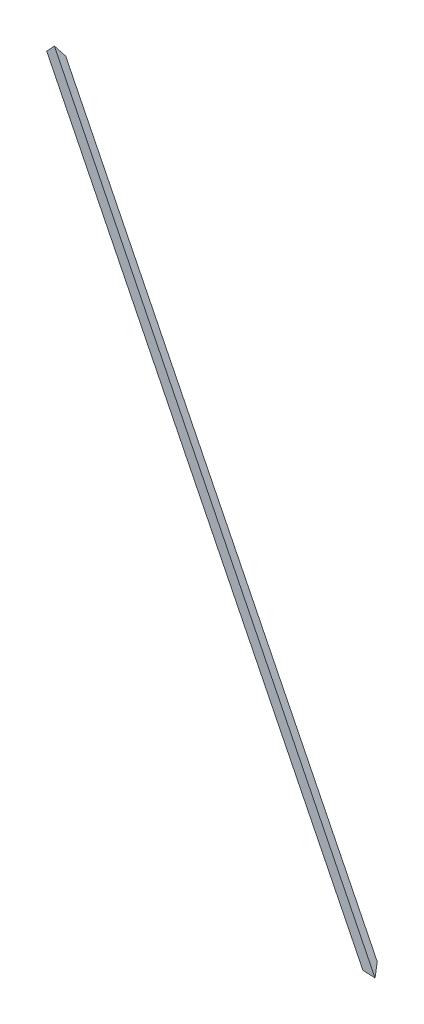
ISO-10303-21;
HEADER;
FILE_DESCRIPTION(('STEP AP214'),'2;1');
FILE_NAME('part.step','',(''),(''),'','','');
FILE_SCHEMA(('AUTOMOTIVE_DESIGN { 1 0 10303 214 1 1 1 1 }'));
ENDSEC;
DATA;
#1=APPLICATION_CONTEXT('core data for automotive mechanical design processes');
#2=APPLICATION_PROTOCOL_DEFINITION('international standard','automotive_design',2000,#1);
#3=PRODUCT_CONTEXT('',#1,'mechanical');
#4=PRODUCT('Part','Part','',(#3));
#5=PRODUCT_RELATED_PRODUCT_CATEGORY('part','',(#4));
#6=PRODUCT_DEFINITION_FORMATION('','',#4);
#7=PRODUCT_DEFINITION_CONTEXT('part definition',#1,'design');
#8=PRODUCT_DEFINITION('design','',#6,#7);
#9=PRODUCT_DEFINITION_SHAPE('','',#8);
#10=(LENGTH_UNIT() NAMED_UNIT(*) SI_UNIT(.MILLI.,.METRE.));
#11=(NAMED_UNIT(*) PLANE_ANGLE_UNIT() SI_UNIT($,.RADIAN.));
#12=(NAMED_UNIT(*) SI_UNIT($,.STERADIAN.) SOLID_ANGLE_UNIT());
#13=UNCERTAINTY_MEASURE_WITH_UNIT(LENGTH_MEASURE(1.E-05),#10,'distance_accuracy_value','');
#14=(GEOMETRIC_REPRESENTATION_CONTEXT(3) GLOBAL_UNCERTAINTY_ASSIGNED_CONTEXT((#13)) GLOBAL_UNIT_ASSIGNED_CONTEXT((#10,
#11,#12)) REPRESENTATION_CONTEXT('',''));
#15=CARTESIAN_POINT('',(0.,0.,0.));
#16=DIRECTION('',(0.,0.,1.));
#17=DIRECTION('',(1.,0.,0.));
#18=AXIS2_PLACEMENT_3D('',#15,#16,#17);
#19=CARTESIAN_POINT('',(8.27489711426216,3.16072944423937,-23.190540472212));
#20=DIRECTION('',(-0.333333333333335,-0.127322003750022,0.934172358962717));
#21=DIRECTION('',(0.94183756467008,0.,0.336068448052377));
#22=AXIS2_PLACEMENT_3D('',#19,#20,#21);
#23=PLANE('',#22);
#24=DIRECTION('',(-0.872677996249969,-0.333333333333326,-0.356822089773087));
#25=VECTOR('',#24,1.);
#26=CARTESIAN_POINT('',(-7.06760589580477,43.3279237970937,-23.1905404722124));
#27=LINE('',#26,#25);
#28=CARTESIAN_POINT('',(6531.48777353879,2540.83384141758,2650.30530176582));
#29=VERTEX_POINT('',#28);
#30=CARTESIAN_POINT('',(6441.67347031891,2506.52783026347,2613.58187399046));
#31=VERTEX_POINT('',#30);
#32=EDGE_CURVE('E49',#29,#31,#27,.T.);
#33=ORIENTED_EDGE('',*,*,#32,.T.);
#34=DIRECTION('',(-0.529104719738794,0.845360491702086,-0.0735787647309975));
#35=VECTOR('',#34,1.);
#36=CARTESIAN_POINT('',(5657.69669864198,3759.10215905608,2504.5598972705));
#37=LINE('',#36,#35);
#38=CARTESIAN_POINT('',(4872.72774204687,5013.26172022143,2395.3999445735));
#39=VERTEX_POINT('',#38);
#40=EDGE_CURVE('E107',#31,#39,#37,.T.);
#41=ORIENTED_EDGE('',*,*,#40,.T.);
#42=DIRECTION('',(-0.654469130781614,-0.681969712719904,-0.326477361828796));
#43=VECTOR('',#42,1.);
#44=CARTESIAN_POINT('',(36.2097667231987,-26.4851816026376,-17.2633190634735));
#45=LINE('',#44,#43);
#46=CARTESIAN_POINT('',(4940.0844179487,5083.44870193542,2429.00035262288));
#47=VERTEX_POINT('',#46);
#48=EDGE_CURVE('E12',#47,#39,#45,.T.);
#49=ORIENTED_EDGE('',*,*,#48,.F.);
#50=DIRECTION('',(-0.529104719738794,0.845360491702086,-0.0735787647309976));
#51=VECTOR('',#50,1.);
#52=CARTESIAN_POINT('',(5736.28218820284,3811.34865549013,2539.72181518288));
#53=LINE('',#52,#51);
#54=EDGE_CURVE('E102',#29,#47,#53,.T.);
#55=ORIENTED_EDGE('',*,*,#54,.F.);
#56=EDGE_LOOP('',(#33,#41,#49,#55));
#57=FACE_BOUND('',#56,.T.);
#58=ADVANCED_FACE('F45',(#57),#23,.F.);
#59=CARTESIAN_POINT('',(0.,0.,0.));
#60=DIRECTION('',(-0.467086179481353,0.356822089773098,0.809016994374947));
#61=DIRECTION('',(0.866025403784441,0.,0.499999999999996));
#62=AXIS2_PLACEMENT_3D('',#59,#60,#61);
#63=PLANE('',#62);
#64=DIRECTION('',(0.872677996249967,0.333333333333332,0.356822089773087));
#65=VECTOR('',#64,1.);
#66=CARTESIAN_POINT('',(0.,0.,0.));
#67=LINE('',#66,#65);
#68=CARTESIAN_POINT('',(6459.2842978254,2467.22705877079,2641.08334516591));
#69=VERTEX_POINT('',#68);
#70=CARTESIAN_POINT('',(6549.09860104528,2501.53306992489,2677.80677294127));
#71=VERTEX_POINT('',#70);
#72=EDGE_CURVE('E101',#69,#71,#67,.T.);
#73=ORIENTED_EDGE('',*,*,#72,.F.);
#74=DIRECTION('',(-0.344646943269872,0.769122902265754,-0.538208552240706));
#75=VECTOR('',#74,1.);
#76=CARTESIAN_POINT('',(5856.14339427187,3813.21167077718,1699.20471012308));
#77=LINE('',#76,#75);
#78=EDGE_CURVE('E62',#69,#31,#77,.T.);
#79=ORIENTED_EDGE('',*,*,#78,.T.);
#80=ORIENTED_EDGE('',*,*,#32,.F.);
#81=DIRECTION('',(-0.344646943269872,0.769122902265754,-0.538208552240706));
#82=VECTOR('',#81,1.);
#83=CARTESIAN_POINT('',(5937.57121417589,3866.23317183668,1722.83161366703));
#84=LINE('',#83,#82);
#85=EDGE_CURVE('E69',#71,#29,#84,.T.);
#86=ORIENTED_EDGE('',*,*,#85,.F.);
#87=EDGE_LOOP('',(#73,#79,#80,#86));
#88=FACE_BOUND('',#87,.T.);
#89=ADVANCED_FACE('F118',(#88),#63,.F.);
#90=CARTESIAN_POINT('',(0.,0.,0.));
#91=DIRECTION('',(-0.0650366103204272,0.480974248354035,-0.87431917040535));
#92=DIRECTION('',(0.,0.876174137459205,0.481994689646699));
#93=AXIS2_PLACEMENT_3D('',#90,#91,#92);
#94=PLANE('',#93);
#95=DIRECTION('',(0.654469130781617,0.681969712719901,0.326477361828797));
#96=VECTOR('',#95,1.);
#97=CARTESIAN_POINT('',(0.,0.,0.));
#98=LINE('',#97,#96);
#99=CARTESIAN_POINT('',(4844.17184578383,5047.72238545407,2416.48134354034));
#100=VERTEX_POINT('',#99);
#101=CARTESIAN_POINT('',(4911.52852168568,5117.90936716807,2450.08175158974));
#102=VERTEX_POINT('',#101);
#103=EDGE_CURVE('E98',#100,#102,#98,.T.);
#104=ORIENTED_EDGE('',*,*,#103,.T.);
#105=DIRECTION('',(0.577222347305059,-0.696579994970428,-0.426134570738677));
#106=VECTOR('',#105,1.);
#107=CARTESIAN_POINT('',(5935.55201724218,3882.13898385792,1694.09609936638));
#108=LINE('',#107,#106);
#109=EDGE_CURVE('E112',#102,#47,#108,.T.);
#110=ORIENTED_EDGE('',*,*,#109,.T.);
#111=ORIENTED_EDGE('',*,*,#48,.T.);
#112=DIRECTION('',(0.577222347305059,-0.696579994970428,-0.426134570738677));
#113=VECTOR('',#112,1.);
#114=CARTESIAN_POINT('',(5854.15188859412,3828.89935057735,1670.86327451201));
#115=LINE('',#114,#113);
#116=EDGE_CURVE('E89',#100,#39,#115,.T.);
#117=ORIENTED_EDGE('',*,*,#116,.F.);
#118=EDGE_LOOP('',(#104,#110,#111,#117));
#119=FACE_BOUND('',#118,.T.);
#120=ADVANCED_FACE('F96',(#119),#94,.T.);
#121=CARTESIAN_POINT('',(0.,0.,0.));
#122=DIRECTION('',(-0.333333333333335,-0.127322003750022,0.934172358962717));
#123=DIRECTION('',(0.94183756467008,0.,0.336068448052377));
#124=AXIS2_PLACEMENT_3D('',#121,#122,#123);
#125=PLANE('',#124);
#126=ORIENTED_EDGE('',*,*,#103,.F.);
#127=DIRECTION('',(0.529104719738794,-0.845360491702086,0.0735787647309977));
#128=VECTOR('',#127,1.);
#129=CARTESIAN_POINT('',(5651.72807180462,3757.47472211242,2528.78234435313));
#130=LINE('',#129,#128);
#131=EDGE_CURVE('E54',#100,#69,#130,.T.);
#132=ORIENTED_EDGE('',*,*,#131,.T.);
#133=ORIENTED_EDGE('',*,*,#72,.T.);
#134=DIRECTION('',(-0.529104719738798,0.845360491702085,-0.073578764730982));
#135=VECTOR('',#134,1.);
#136=CARTESIAN_POINT('',(5730.31356136548,3809.72121854646,2563.94426226552));
#137=LINE('',#136,#135);
#138=EDGE_CURVE('E92',#71,#102,#137,.T.);
#139=ORIENTED_EDGE('',*,*,#138,.T.);
#140=EDGE_LOOP('',(#126,#132,#133,#139));
#141=FACE_BOUND('',#140,.T.);
#142=ADVANCED_FACE('F104',(#141),#125,.T.);
#143=CARTESIAN_POINT('',(5856.14339427185,3813.2116707772,1699.20471012312));
#144=DIRECTION('',(-0.814278199040255,-0.530215010595009,-0.23626903543946));
#145=DIRECTION('',(0.545664026406652,-0.838004039540192,0.));
#146=AXIS2_PLACEMENT_3D('',#143,#144,#145);
#147=PLANE('',#146);
#148=ORIENTED_EDGE('',*,*,#78,.F.);
#149=ORIENTED_EDGE('',*,*,#131,.F.);
#150=ORIENTED_EDGE('',*,*,#116,.T.);
#151=ORIENTED_EDGE('',*,*,#40,.F.);
#152=EDGE_LOOP('',(#148,#149,#150,#151));
#153=FACE_BOUND('',#152,.T.);
#154=ADVANCED_FACE('F88',(#153),#147,.T.);
#155=CARTESIAN_POINT('',(5937.57121417587,3866.2331718367,1722.83161366707));
#156=DIRECTION('',(-0.814278199040255,-0.530215010595009,-0.23626903543946));
#157=DIRECTION('',(-0.529104719738801,0.845360491702084,-0.0735787647309699));
#158=AXIS2_PLACEMENT_3D('',#155,#156,#157);
#159=PLANE('',#158);
#160=ORIENTED_EDGE('',*,*,#138,.F.);
#161=ORIENTED_EDGE('',*,*,#85,.T.);
#162=ORIENTED_EDGE('',*,*,#54,.T.);
#163=ORIENTED_EDGE('',*,*,#109,.F.);
#164=EDGE_LOOP('',(#160,#161,#162,#163));
#165=FACE_BOUND('',#164,.T.);
#166=ADVANCED_FACE('F47',(#165),#159,.F.);
#167=CLOSED_SHELL('',(#58,#89,#120,#142,#154,#166));
#168=MANIFOLD_SOLID_BREP('B2',#167);
#169=ADVANCED_BREP_SHAPE_REPRESENTATION('',(#18,#168),#14);
#170=SHAPE_DEFINITION_REPRESENTATION(#9,#169);
ENDSEC;
END-ISO-10303-21;
